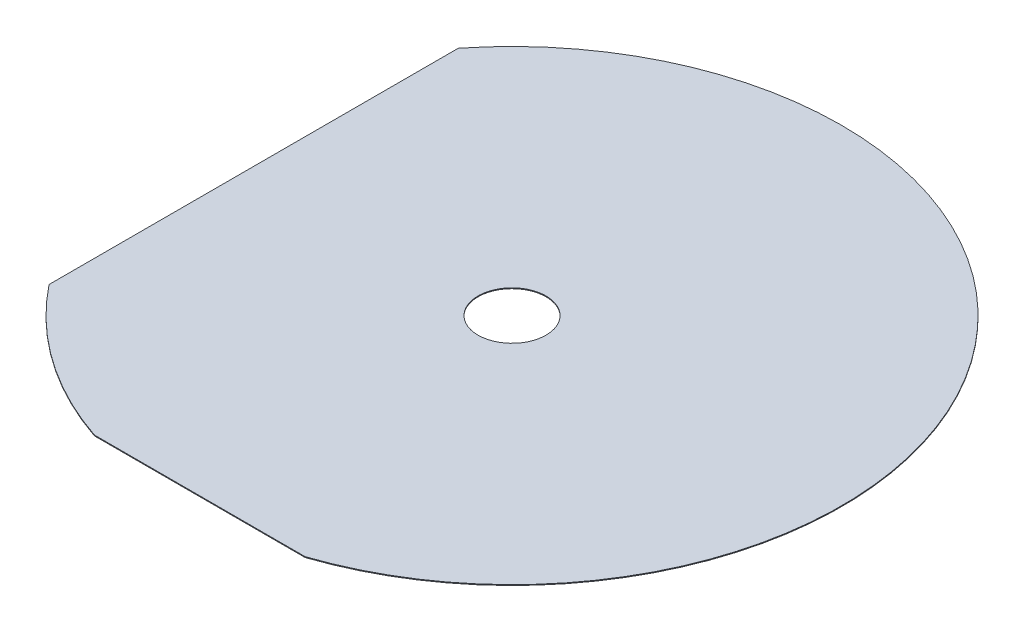
ISO-10303-21;
HEADER;
FILE_DESCRIPTION(('STEP AP214'),'2;1');
FILE_NAME('part.step','',(''),(''),'','','');
FILE_SCHEMA(('AUTOMOTIVE_DESIGN { 1 0 10303 214 1 1 1 1 }'));
ENDSEC;
DATA;
#1=APPLICATION_CONTEXT('core data for automotive mechanical design processes');
#2=APPLICATION_PROTOCOL_DEFINITION('international standard','automotive_design',2000,#1);
#3=PRODUCT_CONTEXT('',#1,'mechanical');
#4=PRODUCT('Part','Part','',(#3));
#5=PRODUCT_RELATED_PRODUCT_CATEGORY('part','',(#4));
#6=PRODUCT_DEFINITION_FORMATION('','',#4);
#7=PRODUCT_DEFINITION_CONTEXT('part definition',#1,'design');
#8=PRODUCT_DEFINITION('design','',#6,#7);
#9=PRODUCT_DEFINITION_SHAPE('','',#8);
#10=(LENGTH_UNIT() NAMED_UNIT(*) SI_UNIT(.MILLI.,.METRE.));
#11=(NAMED_UNIT(*) PLANE_ANGLE_UNIT() SI_UNIT($,.RADIAN.));
#12=(NAMED_UNIT(*) SI_UNIT($,.STERADIAN.) SOLID_ANGLE_UNIT());
#13=UNCERTAINTY_MEASURE_WITH_UNIT(LENGTH_MEASURE(1.E-05),#10,'distance_accuracy_value','');
#14=(GEOMETRIC_REPRESENTATION_CONTEXT(3) GLOBAL_UNCERTAINTY_ASSIGNED_CONTEXT((#13)) GLOBAL_UNIT_ASSIGNED_CONTEXT((#10,
#11,#12)) REPRESENTATION_CONTEXT('',''));
#15=CARTESIAN_POINT('',(0.,0.,0.));
#16=DIRECTION('',(0.,0.,1.));
#17=DIRECTION('',(1.,0.,0.));
#18=AXIS2_PLACEMENT_3D('',#15,#16,#17);
#19=CARTESIAN_POINT('',(0.,1095.,0.));
#20=DIRECTION('',(0.,1.,0.));
#21=DIRECTION('',(0.,0.,1.));
#22=AXIS2_PLACEMENT_3D('',#19,#20,#21);
#23=PLANE('',#22);
#24=CARTESIAN_POINT('',(0.,1095.,0.));
#25=DIRECTION('',(0.,1.,0.));
#26=DIRECTION('',(0.,0.,1.));
#27=AXIS2_PLACEMENT_3D('',#24,#25,#26);
#28=CIRCLE('',#27,824.);
#29=CARTESIAN_POINT('',(-646.,1095.,511.527125380463));
#30=VERTEX_POINT('',#29);
#31=CARTESIAN_POINT('',(-263.5,1095.,780.732828821742));
#32=VERTEX_POINT('',#31);
#33=EDGE_CURVE('E93',#30,#32,#28,.T.);
#34=ORIENTED_EDGE('',*,*,#33,.T.);
#35=DIRECTION('',(1.,0.,0.));
#36=VECTOR('',#35,1.);
#37=CARTESIAN_POINT('',(-263.5,1095.,780.732828821742));
#38=LINE('',#37,#36);
#39=CARTESIAN_POINT('',(263.5,1095.,780.732828821742));
#40=VERTEX_POINT('',#39);
#41=EDGE_CURVE('E88',#32,#40,#38,.T.);
#42=ORIENTED_EDGE('',*,*,#41,.T.);
#43=CARTESIAN_POINT('',(0.,1095.,0.));
#44=DIRECTION('',(0.,1.,0.));
#45=DIRECTION('',(0.,0.,1.));
#46=AXIS2_PLACEMENT_3D('',#43,#44,#45);
#47=CIRCLE('',#46,824.);
#48=CARTESIAN_POINT('',(-646.,1095.,-511.527125380463));
#49=VERTEX_POINT('',#48);
#50=EDGE_CURVE('E91',#40,#49,#47,.T.);
#51=ORIENTED_EDGE('',*,*,#50,.T.);
#52=DIRECTION('',(0.,0.,1.));
#53=VECTOR('',#52,1.);
#54=CARTESIAN_POINT('',(-646.,1095.,511.527125380463));
#55=LINE('',#54,#53);
#56=EDGE_CURVE('E58',#49,#30,#55,.T.);
#57=ORIENTED_EDGE('',*,*,#56,.T.);
#58=EDGE_LOOP('',(#34,#42,#51,#57));
#59=FACE_BOUND('',#58,.T.);
#60=CARTESIAN_POINT('',(0.,1095.,0.));
#61=DIRECTION('',(0.,1.,0.));
#62=DIRECTION('',(0.,0.,1.));
#63=AXIS2_PLACEMENT_3D('',#60,#61,#62);
#64=CIRCLE('',#63,85.);
#65=CARTESIAN_POINT('',(0.,1095.,85.));
#66=VERTEX_POINT('',#65);
#67=EDGE_CURVE('E114',#66,#66,#64,.T.);
#68=ORIENTED_EDGE('',*,*,#67,.F.);
#69=EDGE_LOOP('',(#68));
#70=FACE_BOUND('',#69,.T.);
#71=ADVANCED_FACE('F40',(#59,#70),#23,.T.);
#72=CARTESIAN_POINT('',(0.,1093.,0.));
#73=DIRECTION('',(0.,1.,0.));
#74=DIRECTION('',(0.,0.,1.));
#75=AXIS2_PLACEMENT_3D('',#72,#73,#74);
#76=PLANE('',#75);
#77=CARTESIAN_POINT('',(0.,1093.,0.));
#78=DIRECTION('',(0.,1.,0.));
#79=DIRECTION('',(0.,0.,1.));
#80=AXIS2_PLACEMENT_3D('',#77,#78,#79);
#81=CIRCLE('',#80,824.);
#82=CARTESIAN_POINT('',(-646.,1093.,511.527125380463));
#83=VERTEX_POINT('',#82);
#84=CARTESIAN_POINT('',(-263.5,1093.,780.732828821742));
#85=VERTEX_POINT('',#84);
#86=EDGE_CURVE('E110',#83,#85,#81,.T.);
#87=ORIENTED_EDGE('',*,*,#86,.F.);
#88=DIRECTION('',(0.,0.,1.));
#89=VECTOR('',#88,1.);
#90=CARTESIAN_POINT('',(-646.,1093.,511.527125380463));
#91=LINE('',#90,#89);
#92=CARTESIAN_POINT('',(-646.,1093.,-511.527125380463));
#93=VERTEX_POINT('',#92);
#94=EDGE_CURVE('E81',#93,#83,#91,.T.);
#95=ORIENTED_EDGE('',*,*,#94,.F.);
#96=CARTESIAN_POINT('',(0.,1093.,0.));
#97=DIRECTION('',(0.,1.,0.));
#98=DIRECTION('',(0.,0.,1.));
#99=AXIS2_PLACEMENT_3D('',#96,#97,#98);
#100=CIRCLE('',#99,824.);
#101=CARTESIAN_POINT('',(263.5,1093.,780.732828821742));
#102=VERTEX_POINT('',#101);
#103=EDGE_CURVE('E75',#102,#93,#100,.T.);
#104=ORIENTED_EDGE('',*,*,#103,.F.);
#105=DIRECTION('',(1.,0.,0.));
#106=VECTOR('',#105,1.);
#107=CARTESIAN_POINT('',(-263.5,1093.,780.732828821742));
#108=LINE('',#107,#106);
#109=EDGE_CURVE('E98',#85,#102,#108,.T.);
#110=ORIENTED_EDGE('',*,*,#109,.F.);
#111=EDGE_LOOP('',(#87,#95,#104,#110));
#112=FACE_BOUND('',#111,.T.);
#113=CARTESIAN_POINT('',(0.,1093.,0.));
#114=DIRECTION('',(0.,1.,0.));
#115=DIRECTION('',(0.,0.,1.));
#116=AXIS2_PLACEMENT_3D('',#113,#114,#115);
#117=CIRCLE('',#116,85.);
#118=CARTESIAN_POINT('',(0.,1093.,85.));
#119=VERTEX_POINT('',#118);
#120=EDGE_CURVE('E135',#119,#119,#117,.T.);
#121=ORIENTED_EDGE('',*,*,#120,.T.);
#122=EDGE_LOOP('',(#121));
#123=FACE_BOUND('',#122,.T.);
#124=ADVANCED_FACE('F129',(#112,#123),#76,.F.);
#125=CARTESIAN_POINT('',(0.,1095.,0.));
#126=DIRECTION('',(0.,-1.,0.));
#127=DIRECTION('',(0.,0.,-1.));
#128=AXIS2_PLACEMENT_3D('',#125,#126,#127);
#129=CYLINDRICAL_SURFACE('',#128,824.);
#130=ORIENTED_EDGE('',*,*,#86,.T.);
#131=DIRECTION('',(0.,-1.,0.));
#132=VECTOR('',#131,1.);
#133=CARTESIAN_POINT('',(-263.5,1095.,780.732828821742));
#134=LINE('',#133,#132);
#135=EDGE_CURVE('E11',#32,#85,#134,.T.);
#136=ORIENTED_EDGE('',*,*,#135,.F.);
#137=ORIENTED_EDGE('',*,*,#33,.F.);
#138=DIRECTION('',(0.,-1.,0.));
#139=VECTOR('',#138,1.);
#140=CARTESIAN_POINT('',(-646.,1095.,511.527125380463));
#141=LINE('',#140,#139);
#142=EDGE_CURVE('E106',#30,#83,#141,.T.);
#143=ORIENTED_EDGE('',*,*,#142,.T.);
#144=EDGE_LOOP('',(#130,#136,#137,#143));
#145=FACE_BOUND('',#144,.T.);
#146=ADVANCED_FACE('F42',(#145),#129,.T.);
#147=CARTESIAN_POINT('',(-263.5,1095.,780.732828821742));
#148=DIRECTION('',(0.,0.,-1.));
#149=DIRECTION('',(-1.,0.,0.));
#150=AXIS2_PLACEMENT_3D('',#147,#148,#149);
#151=PLANE('',#150);
#152=ORIENTED_EDGE('',*,*,#109,.T.);
#153=DIRECTION('',(0.,-1.,0.));
#154=VECTOR('',#153,1.);
#155=CARTESIAN_POINT('',(263.5,1095.,780.732828821742));
#156=LINE('',#155,#154);
#157=EDGE_CURVE('E50',#40,#102,#156,.T.);
#158=ORIENTED_EDGE('',*,*,#157,.F.);
#159=ORIENTED_EDGE('',*,*,#41,.F.);
#160=ORIENTED_EDGE('',*,*,#135,.T.);
#161=EDGE_LOOP('',(#152,#158,#159,#160));
#162=FACE_BOUND('',#161,.T.);
#163=ADVANCED_FACE('F97',(#162),#151,.F.);
#164=CARTESIAN_POINT('',(0.,1095.,0.));
#165=DIRECTION('',(0.,-1.,0.));
#166=DIRECTION('',(0.,0.,-1.));
#167=AXIS2_PLACEMENT_3D('',#164,#165,#166);
#168=CYLINDRICAL_SURFACE('',#167,824.);
#169=ORIENTED_EDGE('',*,*,#103,.T.);
#170=DIRECTION('',(0.,-1.,0.));
#171=VECTOR('',#170,1.);
#172=CARTESIAN_POINT('',(-646.,1095.,-511.527125380463));
#173=LINE('',#172,#171);
#174=EDGE_CURVE('E100',#49,#93,#173,.T.);
#175=ORIENTED_EDGE('',*,*,#174,.F.);
#176=ORIENTED_EDGE('',*,*,#50,.F.);
#177=ORIENTED_EDGE('',*,*,#157,.T.);
#178=EDGE_LOOP('',(#169,#175,#176,#177));
#179=FACE_BOUND('',#178,.T.);
#180=ADVANCED_FACE('F101',(#179),#168,.T.);
#181=CARTESIAN_POINT('',(-646.,1095.,511.527125380463));
#182=DIRECTION('',(1.,0.,0.));
#183=DIRECTION('',(0.,0.,-1.));
#184=AXIS2_PLACEMENT_3D('',#181,#182,#183);
#185=PLANE('',#184);
#186=ORIENTED_EDGE('',*,*,#94,.T.);
#187=ORIENTED_EDGE('',*,*,#142,.F.);
#188=ORIENTED_EDGE('',*,*,#56,.F.);
#189=ORIENTED_EDGE('',*,*,#174,.T.);
#190=EDGE_LOOP('',(#186,#187,#188,#189));
#191=FACE_BOUND('',#190,.T.);
#192=ADVANCED_FACE('F126',(#191),#185,.F.);
#193=CARTESIAN_POINT('',(0.,1095.,0.));
#194=DIRECTION('',(0.,-1.,0.));
#195=DIRECTION('',(0.,0.,-1.));
#196=AXIS2_PLACEMENT_3D('',#193,#194,#195);
#197=CYLINDRICAL_SURFACE('',#196,85.);
#198=ORIENTED_EDGE('',*,*,#67,.T.);
#199=EDGE_LOOP('',(#198));
#200=FACE_BOUND('',#199,.T.);
#201=ORIENTED_EDGE('',*,*,#120,.F.);
#202=EDGE_LOOP('',(#201));
#203=FACE_BOUND('',#202,.T.);
#204=ADVANCED_FACE('F143',(#200,#203),#197,.F.);
#205=CLOSED_SHELL('',(#71,#124,#146,#163,#180,#192,#204));
#206=MANIFOLD_SOLID_BREP('B2',#205);
#207=ADVANCED_BREP_SHAPE_REPRESENTATION('',(#18,#206),#14);
#208=SHAPE_DEFINITION_REPRESENTATION(#9,#207);
ENDSEC;
END-ISO-10303-21;
